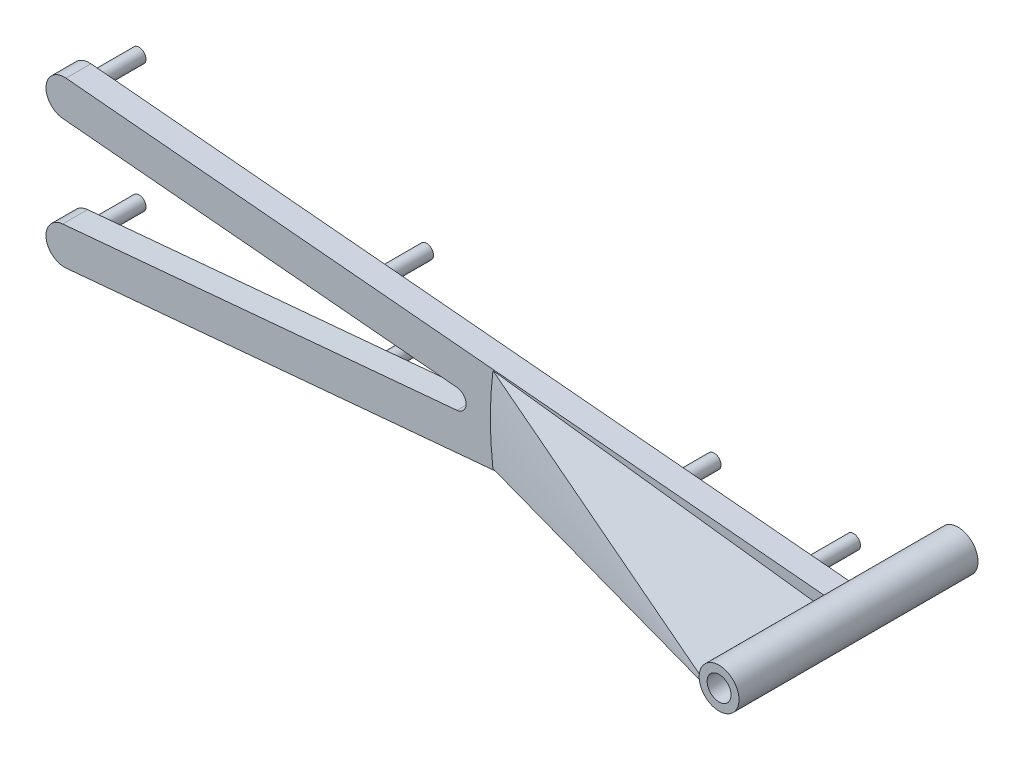
ISO-10303-21;
HEADER;
FILE_DESCRIPTION(('STEP AP214'),'2;1');
FILE_NAME('part.step','',(''),(''),'','','');
FILE_SCHEMA(('AUTOMOTIVE_DESIGN { 1 0 10303 214 1 1 1 1 }'));
ENDSEC;
DATA;
#1=APPLICATION_CONTEXT('core data for automotive mechanical design processes');
#2=APPLICATION_PROTOCOL_DEFINITION('international standard','automotive_design',2000,#1);
#3=PRODUCT_CONTEXT('',#1,'mechanical');
#4=PRODUCT('Part','Part','',(#3));
#5=PRODUCT_RELATED_PRODUCT_CATEGORY('part','',(#4));
#6=PRODUCT_DEFINITION_FORMATION('','',#4);
#7=PRODUCT_DEFINITION_CONTEXT('part definition',#1,'design');
#8=PRODUCT_DEFINITION('design','',#6,#7);
#9=PRODUCT_DEFINITION_SHAPE('','',#8);
#10=(LENGTH_UNIT() NAMED_UNIT(*) SI_UNIT(.MILLI.,.METRE.));
#11=(NAMED_UNIT(*) PLANE_ANGLE_UNIT() SI_UNIT($,.RADIAN.));
#12=(NAMED_UNIT(*) SI_UNIT($,.STERADIAN.) SOLID_ANGLE_UNIT());
#13=UNCERTAINTY_MEASURE_WITH_UNIT(LENGTH_MEASURE(1.E-05),#10,'distance_accuracy_value','');
#14=(GEOMETRIC_REPRESENTATION_CONTEXT(3) GLOBAL_UNCERTAINTY_ASSIGNED_CONTEXT((#13)) GLOBAL_UNIT_ASSIGNED_CONTEXT((#10,
#11,#12)) REPRESENTATION_CONTEXT('',''));
#15=CARTESIAN_POINT('',(0.,0.,0.));
#16=DIRECTION('',(0.,0.,1.));
#17=DIRECTION('',(1.,0.,0.));
#18=AXIS2_PLACEMENT_3D('',#15,#16,#17);
#19=CARTESIAN_POINT('',(544.102231746038,-8.15707225850537,8.255));
#20=DIRECTION('',(0.,0.,1.));
#21=DIRECTION('',(1.,0.,0.));
#22=AXIS2_PLACEMENT_3D('',#19,#20,#21);
#23=PLANE('',#22);
#24=CARTESIAN_POINT('',(642.837082689009,0.,8.255));
#25=DIRECTION('',(0.,0.,1.));
#26=DIRECTION('',(1.,0.,0.));
#27=AXIS2_PLACEMENT_3D('',#24,#25,#26);
#28=CIRCLE('',#27,2.53999999999984);
#29=CARTESIAN_POINT('',(640.969745333569,-1.72181625064283,8.255));
#30=VERTEX_POINT('',#29);
#31=CARTESIAN_POINT('',(640.31601546384,-0.309548132249066,8.255));
#32=VERTEX_POINT('',#31);
#33=EDGE_CURVE('E192',#30,#32,#28,.F.);
#34=ORIENTED_EDGE('',*,*,#33,.T.);
#35=DIRECTION('',(-0.992546151641322,-0.121869343405148,0.));
#36=VECTOR('',#35,1.);
#37=CARTESIAN_POINT('',(4.79161013369886,-78.3421331837901,8.25500000000008));
#38=LINE('',#37,#36);
#39=CARTESIAN_POINT('',(598.756563819367,-5.41240715378111,8.25500000000001));
#40=VERTEX_POINT('',#39);
#41=EDGE_CURVE('E272',#32,#40,#38,.T.);
#42=ORIENTED_EDGE('',*,*,#41,.T.);
#43=CARTESIAN_POINT('',(642.837082689009,0.,8.25500000000001));
#44=DIRECTION('',(0.,0.,-1.));
#45=DIRECTION('',(-1.,0.,0.));
#46=AXIS2_PLACEMENT_3D('',#43,#44,#45);
#47=CIRCLE('',#46,44.4115558724877);
#48=CARTESIAN_POINT('',(598.756563819367,5.41240715378112,8.25500000000001));
#49=VERTEX_POINT('',#48);
#50=EDGE_CURVE('E267',#40,#49,#47,.T.);
#51=ORIENTED_EDGE('',*,*,#50,.T.);
#52=DIRECTION('',(-0.992546151641322,0.121869343405148,0.));
#53=VECTOR('',#52,1.);
#54=CARTESIAN_POINT('',(4.79161013369889,78.3421331837901,8.25500000000008));
#55=LINE('',#54,#53);
#56=CARTESIAN_POINT('',(640.31601546384,0.309548132249052,8.255));
#57=VERTEX_POINT('',#56);
#58=EDGE_CURVE('E142',#57,#49,#55,.T.);
#59=ORIENTED_EDGE('',*,*,#58,.F.);
#60=CARTESIAN_POINT('',(640.969745333569,1.72181625064275,8.255));
#61=VERTEX_POINT('',#60);
#62=EDGE_CURVE('E149',#57,#61,#28,.F.);
#63=ORIENTED_EDGE('',*,*,#62,.T.);
#64=DIRECTION('',(-0.995912017990539,0.090328580316597,0.));
#65=VECTOR('',#64,1.);
#66=CARTESIAN_POINT('',(640.969745333569,1.72181625064282,8.255));
#67=LINE('',#66,#65);
#68=CARTESIAN_POINT('',(544.31368699473,10.4884586558245,8.255));
#69=VERTEX_POINT('',#68);
#70=EDGE_CURVE('E165',#61,#69,#67,.T.);
#71=ORIENTED_EDGE('',*,*,#70,.T.);
#72=CARTESIAN_POINT('',(544.102231746038,8.15707225850582,8.255));
#73=DIRECTION('',(0.,0.,1.));
#74=DIRECTION('',(1.,0.,0.));
#75=AXIS2_PLACEMENT_3D('',#72,#73,#74);
#76=CIRCLE('',#75,2.34095618408417);
#77=CARTESIAN_POINT('',(543.890776497347,5.82568586118712,8.255));
#78=VERTEX_POINT('',#77);
#79=EDGE_CURVE('E168',#69,#78,#76,.T.);
#80=ORIENTED_EDGE('',*,*,#79,.T.);
#81=DIRECTION('',(0.995912017990539,-0.0903285803166027,0.));
#82=VECTOR('',#81,1.);
#83=CARTESIAN_POINT('',(608.121505485427,0.,8.255));
#84=LINE('',#83,#82);
#85=CARTESIAN_POINT('',(594.176442416695,1.26480826284806,8.255));
#86=VERTEX_POINT('',#85);
#87=EDGE_CURVE('E170',#78,#86,#84,.T.);
#88=ORIENTED_EDGE('',*,*,#87,.T.);
#89=CARTESIAN_POINT('',(594.061725119693,0.,8.255));
#90=DIRECTION('',(0.,0.,1.));
#91=DIRECTION('',(1.,0.,0.));
#92=AXIS2_PLACEMENT_3D('',#89,#90,#91);
#93=CIRCLE('',#92,1.27);
#94=CARTESIAN_POINT('',(594.176442416695,-1.26480826284791,8.255));
#95=VERTEX_POINT('',#94);
#96=EDGE_CURVE('E11',#86,#95,#93,.F.);
#97=ORIENTED_EDGE('',*,*,#96,.T.);
#98=DIRECTION('',(-0.995912017990539,-0.0903285803165969,0.));
#99=VECTOR('',#98,1.);
#100=CARTESIAN_POINT('',(608.121505485427,0.,8.255));
#101=LINE('',#100,#99);
#102=CARTESIAN_POINT('',(543.890776497347,-5.82568586118667,8.255));
#103=VERTEX_POINT('',#102);
#104=EDGE_CURVE('E172',#95,#103,#101,.T.);
#105=ORIENTED_EDGE('',*,*,#104,.T.);
#106=CARTESIAN_POINT('',(544.102231746038,-8.15707225850537,8.255));
#107=DIRECTION('',(0.,0.,1.));
#108=DIRECTION('',(1.,0.,0.));
#109=AXIS2_PLACEMENT_3D('',#106,#107,#108);
#110=CIRCLE('',#109,2.34095618408416);
#111=CARTESIAN_POINT('',(544.31368699473,-10.4884586558241,8.255));
#112=VERTEX_POINT('',#111);
#113=EDGE_CURVE('E174',#103,#112,#110,.T.);
#114=ORIENTED_EDGE('',*,*,#113,.T.);
#115=DIRECTION('',(0.995912017990539,0.0903285803165972,0.));
#116=VECTOR('',#115,1.);
#117=CARTESIAN_POINT('',(617.6485379377,-3.83703478127984,8.255));
#118=LINE('',#117,#116);
#119=EDGE_CURVE('E163',#112,#30,#118,.T.);
#120=ORIENTED_EDGE('',*,*,#119,.T.);
#121=EDGE_LOOP('',(#34,#42,#51,#59,#63,#71,#80,#88,#97,#105,#114,#120));
#122=FACE_BOUND('',#121,.T.);
#123=ADVANCED_FACE('F41',(#122),#23,.T.);
#124=CARTESIAN_POINT('',(642.837082689009,0.,8.255));
#125=DIRECTION('',(0.,0.,-1.));
#126=DIRECTION('',(-1.,0.,0.));
#127=AXIS2_PLACEMENT_3D('',#124,#125,#126);
#128=CYLINDRICAL_SURFACE('',#127,2.5399999999999);
#129=CARTESIAN_POINT('',(642.837082689009,0.,-6.985));
#130=DIRECTION('',(0.,0.,1.));
#131=DIRECTION('',(1.,0.,0.));
#132=AXIS2_PLACEMENT_3D('',#129,#130,#131);
#133=CIRCLE('',#132,2.53999999999984);
#134=CARTESIAN_POINT('',(645.377082689008,0.,-6.985));
#135=VERTEX_POINT('',#134);
#136=EDGE_CURVE('E152',#135,#135,#133,.T.);
#137=ORIENTED_EDGE('',*,*,#136,.T.);
#138=EDGE_LOOP('',(#137));
#139=FACE_BOUND('',#138,.T.);
#140=DIRECTION('',(0.,0.,1.));
#141=VECTOR('',#140,1.);
#142=CARTESIAN_POINT('',(640.31601546384,-0.309548132249066,0.));
#143=LINE('',#142,#141);
#144=CARTESIAN_POINT('',(640.31601546384,-0.309548132249054,23.495));
#145=VERTEX_POINT('',#144);
#146=EDGE_CURVE('E56',#32,#145,#143,.T.);
#147=ORIENTED_EDGE('',*,*,#146,.F.);
#148=ORIENTED_EDGE('',*,*,#33,.F.);
#149=DIRECTION('',(0.,0.,-1.));
#150=VECTOR('',#149,1.);
#151=CARTESIAN_POINT('',(640.969745333569,-1.72181625064283,8.255));
#152=LINE('',#151,#150);
#153=CARTESIAN_POINT('',(640.969745333569,-1.72181625064282,5.08));
#154=VERTEX_POINT('',#153);
#155=EDGE_CURVE('E246',#30,#154,#152,.T.);
#156=ORIENTED_EDGE('',*,*,#155,.T.);
#157=CARTESIAN_POINT('',(642.837082689009,0.,5.08));
#158=DIRECTION('',(0.,0.,1.));
#159=DIRECTION('',(1.,0.,0.));
#160=AXIS2_PLACEMENT_3D('',#157,#158,#159);
#161=CIRCLE('',#160,2.53999999999984);
#162=CARTESIAN_POINT('',(640.969745333569,1.72181625064282,5.08));
#163=VERTEX_POINT('',#162);
#164=EDGE_CURVE('E134',#154,#163,#161,.F.);
#165=ORIENTED_EDGE('',*,*,#164,.T.);
#166=DIRECTION('',(0.,0.,-1.));
#167=VECTOR('',#166,1.);
#168=CARTESIAN_POINT('',(640.969745333569,1.72181625064282,8.255));
#169=LINE('',#168,#167);
#170=EDGE_CURVE('E248',#61,#163,#169,.T.);
#171=ORIENTED_EDGE('',*,*,#170,.F.);
#172=ORIENTED_EDGE('',*,*,#62,.F.);
#173=DIRECTION('',(0.,0.,1.));
#174=VECTOR('',#173,1.);
#175=CARTESIAN_POINT('',(640.31601546384,0.309548132249052,0.));
#176=LINE('',#175,#174);
#177=CARTESIAN_POINT('',(640.31601546384,0.309548132249052,23.495));
#178=VERTEX_POINT('',#177);
#179=EDGE_CURVE('E140',#57,#178,#176,.T.);
#180=ORIENTED_EDGE('',*,*,#179,.T.);
#181=CARTESIAN_POINT('',(642.837082689009,0.,23.495));
#182=DIRECTION('',(0.,0.,1.));
#183=DIRECTION('',(1.,0.,0.));
#184=AXIS2_PLACEMENT_3D('',#181,#182,#183);
#185=CIRCLE('',#184,2.53999999999984);
#186=EDGE_CURVE('E135',#145,#178,#185,.T.);
#187=ORIENTED_EDGE('',*,*,#186,.F.);
#188=EDGE_LOOP('',(#147,#148,#156,#165,#171,#172,#180,#187));
#189=FACE_BOUND('',#188,.T.);
#190=ADVANCED_FACE('F147',(#139,#189),#128,.T.);
#191=CARTESIAN_POINT('',(544.102231746038,-8.15707225850537,5.08));
#192=DIRECTION('',(0.,0.,1.));
#193=DIRECTION('',(1.,0.,0.));
#194=AXIS2_PLACEMENT_3D('',#191,#192,#193);
#195=PLANE('',#194);
#196=CARTESIAN_POINT('',(635.217082689009,0.,5.08));
#197=DIRECTION('',(0.,0.,1.));
#198=DIRECTION('',(1.,0.,0.));
#199=AXIS2_PLACEMENT_3D('',#196,#197,#198);
#200=CIRCLE('',#199,0.889000000000045);
#201=CARTESIAN_POINT('',(636.106082689009,0.,5.08));
#202=VERTEX_POINT('',#201);
#203=EDGE_CURVE('E204',#202,#202,#200,.F.);
#204=ORIENTED_EDGE('',*,*,#203,.F.);
#205=EDGE_LOOP('',(#204));
#206=FACE_BOUND('',#205,.T.);
#207=CARTESIAN_POINT('',(617.437082689009,0.,5.08));
#208=DIRECTION('',(0.,0.,1.));
#209=DIRECTION('',(1.,0.,0.));
#210=AXIS2_PLACEMENT_3D('',#207,#208,#209);
#211=CIRCLE('',#210,0.889000000000045);
#212=CARTESIAN_POINT('',(618.326082689009,0.,5.08));
#213=VERTEX_POINT('',#212);
#214=EDGE_CURVE('E201',#213,#213,#211,.F.);
#215=ORIENTED_EDGE('',*,*,#214,.F.);
#216=EDGE_LOOP('',(#215));
#217=FACE_BOUND('',#216,.T.);
#218=CARTESIAN_POINT('',(580.769657217523,-4.83136032123327,5.08));
#219=DIRECTION('',(0.,0.,1.));
#220=DIRECTION('',(1.,0.,0.));
#221=AXIS2_PLACEMENT_3D('',#218,#219,#220);
#222=CIRCLE('',#221,0.889000000000045);
#223=CARTESIAN_POINT('',(581.658657217523,-4.83136032123327,5.08));
#224=VERTEX_POINT('',#223);
#225=EDGE_CURVE('E198',#224,#224,#222,.F.);
#226=ORIENTED_EDGE('',*,*,#225,.F.);
#227=EDGE_LOOP('',(#226));
#228=FACE_BOUND('',#227,.T.);
#229=CARTESIAN_POINT('',(580.769657217523,4.8313603212335,5.08));
#230=DIRECTION('',(0.,0.,1.));
#231=DIRECTION('',(1.,0.,0.));
#232=AXIS2_PLACEMENT_3D('',#229,#230,#231);
#233=CIRCLE('',#232,0.889000000000045);
#234=CARTESIAN_POINT('',(581.658657217523,4.8313603212335,5.08));
#235=VERTEX_POINT('',#234);
#236=EDGE_CURVE('E195',#235,#235,#233,.F.);
#237=ORIENTED_EDGE('',*,*,#236,.F.);
#238=EDGE_LOOP('',(#237));
#239=FACE_BOUND('',#238,.T.);
#240=CARTESIAN_POINT('',(544.102231746038,-8.15707225850537,5.08));
#241=DIRECTION('',(0.,0.,1.));
#242=DIRECTION('',(1.,0.,0.));
#243=AXIS2_PLACEMENT_3D('',#240,#241,#242);
#244=CIRCLE('',#243,0.889000000000045);
#245=CARTESIAN_POINT('',(544.991231746038,-8.15707225850537,5.08));
#246=VERTEX_POINT('',#245);
#247=EDGE_CURVE('E191',#246,#246,#244,.F.);
#248=ORIENTED_EDGE('',*,*,#247,.F.);
#249=EDGE_LOOP('',(#248));
#250=FACE_BOUND('',#249,.T.);
#251=CARTESIAN_POINT('',(544.102231746038,8.15707225850582,5.08));
#252=DIRECTION('',(0.,0.,1.));
#253=DIRECTION('',(1.,0.,0.));
#254=AXIS2_PLACEMENT_3D('',#251,#252,#253);
#255=CIRCLE('',#254,0.889000000000045);
#256=CARTESIAN_POINT('',(544.991231746038,8.15707225850582,5.08));
#257=VERTEX_POINT('',#256);
#258=EDGE_CURVE('E188',#257,#257,#255,.F.);
#259=ORIENTED_EDGE('',*,*,#258,.F.);
#260=EDGE_LOOP('',(#259));
#261=FACE_BOUND('',#260,.T.);
#262=ORIENTED_EDGE('',*,*,#164,.F.);
#263=DIRECTION('',(0.995912017990539,0.0903285803165964,0.));
#264=VECTOR('',#263,1.);
#265=CARTESIAN_POINT('',(640.969745333569,-1.72181625064283,5.08));
#266=LINE('',#265,#264);
#267=CARTESIAN_POINT('',(544.31368699473,-10.4884586558241,5.08));
#268=VERTEX_POINT('',#267);
#269=EDGE_CURVE('E162',#268,#154,#266,.T.);
#270=ORIENTED_EDGE('',*,*,#269,.F.);
#271=CARTESIAN_POINT('',(544.102231746038,-8.15707225850537,5.08));
#272=DIRECTION('',(0.,0.,1.));
#273=DIRECTION('',(1.,0.,0.));
#274=AXIS2_PLACEMENT_3D('',#271,#272,#273);
#275=CIRCLE('',#274,2.34095618408416);
#276=CARTESIAN_POINT('',(543.890776497347,-5.82568586118667,5.08));
#277=VERTEX_POINT('',#276);
#278=EDGE_CURVE('E166',#277,#268,#275,.T.);
#279=ORIENTED_EDGE('',*,*,#278,.F.);
#280=DIRECTION('',(-0.995912017990539,-0.0903285803165969,0.));
#281=VECTOR('',#280,1.);
#282=CARTESIAN_POINT('',(608.121505485427,0.,5.08));
#283=LINE('',#282,#281);
#284=CARTESIAN_POINT('',(594.176442416695,-1.26480826284791,5.08));
#285=VERTEX_POINT('',#284);
#286=EDGE_CURVE('E216',#285,#277,#283,.T.);
#287=ORIENTED_EDGE('',*,*,#286,.F.);
#288=CARTESIAN_POINT('',(594.061725119693,0.,5.08));
#289=DIRECTION('',(0.,0.,1.));
#290=DIRECTION('',(1.,0.,0.));
#291=AXIS2_PLACEMENT_3D('',#288,#289,#290);
#292=CIRCLE('',#291,1.27);
#293=CARTESIAN_POINT('',(594.176442416695,1.26480826284806,5.08));
#294=VERTEX_POINT('',#293);
#295=EDGE_CURVE('E49',#285,#294,#292,.T.);
#296=ORIENTED_EDGE('',*,*,#295,.T.);
#297=DIRECTION('',(0.995912017990539,-0.0903285803166027,0.));
#298=VECTOR('',#297,1.);
#299=CARTESIAN_POINT('',(608.121505485427,0.,5.08));
#300=LINE('',#299,#298);
#301=CARTESIAN_POINT('',(543.890776497347,5.82568586118712,5.08));
#302=VERTEX_POINT('',#301);
#303=EDGE_CURVE('E213',#302,#294,#300,.T.);
#304=ORIENTED_EDGE('',*,*,#303,.F.);
#305=CARTESIAN_POINT('',(544.102231746038,8.15707225850582,5.08));
#306=DIRECTION('',(0.,0.,1.));
#307=DIRECTION('',(1.,0.,0.));
#308=AXIS2_PLACEMENT_3D('',#305,#306,#307);
#309=CIRCLE('',#308,2.34095618408417);
#310=CARTESIAN_POINT('',(544.31368699473,10.4884586558245,5.08));
#311=VERTEX_POINT('',#310);
#312=EDGE_CURVE('E185',#311,#302,#309,.T.);
#313=ORIENTED_EDGE('',*,*,#312,.F.);
#314=DIRECTION('',(-0.995912017990539,0.090328580316603,0.));
#315=VECTOR('',#314,1.);
#316=CARTESIAN_POINT('',(617.6485379377,3.83703478127986,5.08));
#317=LINE('',#316,#315);
#318=EDGE_CURVE('E186',#163,#311,#317,.T.);
#319=ORIENTED_EDGE('',*,*,#318,.F.);
#320=EDGE_LOOP('',(#262,#270,#279,#287,#296,#304,#313,#319));
#321=FACE_BOUND('',#320,.T.);
#322=ADVANCED_FACE('F212',(#206,#217,#228,#239,#250,#261,#321),#195,.F.);
#323=CARTESIAN_POINT('',(640.969745333569,-1.72181625064283,8.255));
#324=DIRECTION('',(-0.0903285803165964,0.995912017990539,0.));
#325=DIRECTION('',(-0.995912017990539,-0.0903285803165964,0.));
#326=AXIS2_PLACEMENT_3D('',#323,#324,#325);
#327=PLANE('',#326);
#328=ORIENTED_EDGE('',*,*,#269,.T.);
#329=ORIENTED_EDGE('',*,*,#155,.F.);
#330=ORIENTED_EDGE('',*,*,#119,.F.);
#331=DIRECTION('',(0.,0.,-1.));
#332=VECTOR('',#331,1.);
#333=CARTESIAN_POINT('',(544.31368699473,-10.4884586558241,8.255));
#334=LINE('',#333,#332);
#335=EDGE_CURVE('E176',#112,#268,#334,.T.);
#336=ORIENTED_EDGE('',*,*,#335,.T.);
#337=EDGE_LOOP('',(#328,#329,#330,#336));
#338=FACE_BOUND('',#337,.T.);
#339=ADVANCED_FACE('F247',(#338),#327,.F.);
#340=CARTESIAN_POINT('',(617.6485379377,3.83703478127986,8.255));
#341=DIRECTION('',(-0.090328580316603,-0.995912017990539,0.));
#342=DIRECTION('',(0.995912017990539,-0.090328580316603,0.));
#343=AXIS2_PLACEMENT_3D('',#340,#341,#342);
#344=PLANE('',#343);
#345=ORIENTED_EDGE('',*,*,#170,.T.);
#346=ORIENTED_EDGE('',*,*,#318,.T.);
#347=DIRECTION('',(0.,0.,-1.));
#348=VECTOR('',#347,1.);
#349=CARTESIAN_POINT('',(544.31368699473,10.4884586558245,8.255));
#350=LINE('',#349,#348);
#351=EDGE_CURVE('E253',#69,#311,#350,.T.);
#352=ORIENTED_EDGE('',*,*,#351,.F.);
#353=ORIENTED_EDGE('',*,*,#70,.F.);
#354=EDGE_LOOP('',(#345,#346,#352,#353));
#355=FACE_BOUND('',#354,.T.);
#356=ADVANCED_FACE('F265',(#355),#344,.F.);
#357=CARTESIAN_POINT('',(544.102231746038,8.15707225850582,8.255));
#358=DIRECTION('',(0.,0.,-1.));
#359=DIRECTION('',(-1.,0.,0.));
#360=AXIS2_PLACEMENT_3D('',#357,#358,#359);
#361=CYLINDRICAL_SURFACE('',#360,2.34095618408417);
#362=ORIENTED_EDGE('',*,*,#312,.T.);
#363=DIRECTION('',(0.,0.,-1.));
#364=VECTOR('',#363,1.);
#365=CARTESIAN_POINT('',(543.890776497347,5.82568586118712,8.255));
#366=LINE('',#365,#364);
#367=EDGE_CURVE('E222',#78,#302,#366,.T.);
#368=ORIENTED_EDGE('',*,*,#367,.F.);
#369=ORIENTED_EDGE('',*,*,#79,.F.);
#370=ORIENTED_EDGE('',*,*,#351,.T.);
#371=EDGE_LOOP('',(#362,#368,#369,#370));
#372=FACE_BOUND('',#371,.T.);
#373=ADVANCED_FACE('F260',(#372),#361,.T.);
#374=CARTESIAN_POINT('',(608.121505485427,0.,8.255));
#375=DIRECTION('',(0.0903285803166027,0.995912017990539,0.));
#376=DIRECTION('',(-0.995912017990539,0.0903285803166027,0.));
#377=AXIS2_PLACEMENT_3D('',#374,#375,#376);
#378=PLANE('',#377);
#379=ORIENTED_EDGE('',*,*,#303,.T.);
#380=DIRECTION('',(0.,0.,-1.));
#381=VECTOR('',#380,1.);
#382=CARTESIAN_POINT('',(594.176442416695,1.26480826284806,8.255));
#383=LINE('',#382,#381);
#384=EDGE_CURVE('E64',#294,#86,#383,.F.);
#385=ORIENTED_EDGE('',*,*,#384,.T.);
#386=ORIENTED_EDGE('',*,*,#87,.F.);
#387=ORIENTED_EDGE('',*,*,#367,.T.);
#388=EDGE_LOOP('',(#379,#385,#386,#387));
#389=FACE_BOUND('',#388,.T.);
#390=ADVANCED_FACE('F220',(#389),#378,.F.);
#391=CARTESIAN_POINT('',(608.121505485427,0.,8.255));
#392=DIRECTION('',(0.0903285803165969,-0.995912017990539,0.));
#393=DIRECTION('',(0.995912017990539,0.090328580316597,0.));
#394=AXIS2_PLACEMENT_3D('',#391,#392,#393);
#395=PLANE('',#394);
#396=ORIENTED_EDGE('',*,*,#104,.F.);
#397=DIRECTION('',(0.,0.,-1.));
#398=VECTOR('',#397,1.);
#399=CARTESIAN_POINT('',(594.176442416695,-1.26480826284791,5.08));
#400=LINE('',#399,#398);
#401=EDGE_CURVE('E207',#95,#285,#400,.T.);
#402=ORIENTED_EDGE('',*,*,#401,.T.);
#403=ORIENTED_EDGE('',*,*,#286,.T.);
#404=DIRECTION('',(0.,0.,-1.));
#405=VECTOR('',#404,1.);
#406=CARTESIAN_POINT('',(543.890776497347,-5.82568586118667,8.255));
#407=LINE('',#406,#405);
#408=EDGE_CURVE('E232',#103,#277,#407,.T.);
#409=ORIENTED_EDGE('',*,*,#408,.F.);
#410=EDGE_LOOP('',(#396,#402,#403,#409));
#411=FACE_BOUND('',#410,.T.);
#412=ADVANCED_FACE('F230',(#411),#395,.F.);
#413=CARTESIAN_POINT('',(544.102231746038,-8.15707225850537,8.255));
#414=DIRECTION('',(0.,0.,-1.));
#415=DIRECTION('',(-1.,0.,0.));
#416=AXIS2_PLACEMENT_3D('',#413,#414,#415);
#417=CYLINDRICAL_SURFACE('',#416,2.34095618408416);
#418=ORIENTED_EDGE('',*,*,#278,.T.);
#419=ORIENTED_EDGE('',*,*,#335,.F.);
#420=ORIENTED_EDGE('',*,*,#113,.F.);
#421=ORIENTED_EDGE('',*,*,#408,.T.);
#422=EDGE_LOOP('',(#418,#419,#420,#421));
#423=FACE_BOUND('',#422,.T.);
#424=ADVANCED_FACE('F238',(#423),#417,.T.);
#425=CARTESIAN_POINT('',(642.837082689009,0.,23.495));
#426=DIRECTION('',(0.,0.,1.));
#427=DIRECTION('',(1.,0.,0.));
#428=AXIS2_PLACEMENT_3D('',#425,#426,#427);
#429=PLANE('',#428);
#430=CARTESIAN_POINT('',(642.837082689009,0.,23.495));
#431=DIRECTION('',(0.,0.,1.));
#432=DIRECTION('',(1.,0.,0.));
#433=AXIS2_PLACEMENT_3D('',#430,#431,#432);
#434=CIRCLE('',#433,1.52400000000007);
#435=CARTESIAN_POINT('',(644.361082689009,0.,23.495));
#436=VERTEX_POINT('',#435);
#437=EDGE_CURVE('E157',#436,#436,#434,.T.);
#438=ORIENTED_EDGE('',*,*,#437,.F.);
#439=EDGE_LOOP('',(#438));
#440=FACE_BOUND('',#439,.T.);
#441=EDGE_CURVE('E125',#178,#145,#185,.T.);
#442=ORIENTED_EDGE('',*,*,#441,.T.);
#443=ORIENTED_EDGE('',*,*,#186,.T.);
#444=EDGE_LOOP('',(#442,#443));
#445=FACE_BOUND('',#444,.T.);
#446=ADVANCED_FACE('F151',(#440,#445),#429,.T.);
#447=CARTESIAN_POINT('',(642.837082689009,0.,-6.985));
#448=DIRECTION('',(0.,0.,1.));
#449=DIRECTION('',(1.,0.,0.));
#450=AXIS2_PLACEMENT_3D('',#447,#448,#449);
#451=PLANE('',#450);
#452=ORIENTED_EDGE('',*,*,#136,.F.);
#453=EDGE_LOOP('',(#452));
#454=FACE_BOUND('',#453,.T.);
#455=ADVANCED_FACE('F301',(#454),#451,.F.);
#456=CARTESIAN_POINT('',(642.837082689009,0.,-1.905));
#457=DIRECTION('',(0.,0.,1.));
#458=DIRECTION('',(1.,0.,0.));
#459=AXIS2_PLACEMENT_3D('',#456,#457,#458);
#460=CYLINDRICAL_SURFACE('',#459,1.52400000000007);
#461=CARTESIAN_POINT('',(642.837082689009,0.,-1.905));
#462=DIRECTION('',(0.,0.,1.));
#463=DIRECTION('',(1.,0.,0.));
#464=AXIS2_PLACEMENT_3D('',#461,#462,#463);
#465=CIRCLE('',#464,1.52400000000007);
#466=CARTESIAN_POINT('',(644.361082689009,0.,-1.905));
#467=VERTEX_POINT('',#466);
#468=EDGE_CURVE('E154',#467,#467,#465,.T.);
#469=ORIENTED_EDGE('',*,*,#468,.F.);
#470=EDGE_LOOP('',(#469));
#471=FACE_BOUND('',#470,.T.);
#472=ORIENTED_EDGE('',*,*,#437,.T.);
#473=EDGE_LOOP('',(#472));
#474=FACE_BOUND('',#473,.T.);
#475=ADVANCED_FACE('F298',(#471,#474),#460,.F.);
#476=CARTESIAN_POINT('',(642.837082689009,0.,-1.905));
#477=DIRECTION('',(0.,0.,1.));
#478=DIRECTION('',(1.,0.,0.));
#479=AXIS2_PLACEMENT_3D('',#476,#477,#478);
#480=PLANE('',#479);
#481=ORIENTED_EDGE('',*,*,#468,.T.);
#482=EDGE_LOOP('',(#481));
#483=FACE_BOUND('',#482,.T.);
#484=ADVANCED_FACE('F368',(#483),#480,.T.);
#485=CARTESIAN_POINT('',(544.102231746038,8.15707225850582,-1.27));
#486=DIRECTION('',(0.,0.,1.));
#487=DIRECTION('',(1.,0.,0.));
#488=AXIS2_PLACEMENT_3D('',#485,#486,#487);
#489=CYLINDRICAL_SURFACE('',#488,0.889000000000045);
#490=CARTESIAN_POINT('',(544.102231746038,8.15707225850582,-1.27));
#491=DIRECTION('',(0.,0.,-1.));
#492=DIRECTION('',(-1.,0.,0.));
#493=AXIS2_PLACEMENT_3D('',#490,#491,#492);
#494=CIRCLE('',#493,0.889000000000045);
#495=CARTESIAN_POINT('',(543.213231746038,8.15707225850582,-1.27));
#496=VERTEX_POINT('',#495);
#497=EDGE_CURVE('E290',#496,#496,#494,.T.);
#498=ORIENTED_EDGE('',*,*,#497,.F.);
#499=EDGE_LOOP('',(#498));
#500=FACE_BOUND('',#499,.T.);
#501=ORIENTED_EDGE('',*,*,#258,.T.);
#502=EDGE_LOOP('',(#501));
#503=FACE_BOUND('',#502,.T.);
#504=ADVANCED_FACE('F362',(#500,#503),#489,.T.);
#505=CARTESIAN_POINT('',(544.102231746038,8.15707225850582,-1.27));
#506=DIRECTION('',(0.,0.,-1.));
#507=DIRECTION('',(-1.,0.,0.));
#508=AXIS2_PLACEMENT_3D('',#505,#506,#507);
#509=PLANE('',#508);
#510=ORIENTED_EDGE('',*,*,#497,.T.);
#511=EDGE_LOOP('',(#510));
#512=FACE_BOUND('',#511,.T.);
#513=ADVANCED_FACE('F367',(#512),#509,.T.);
#514=CARTESIAN_POINT('',(544.102231746038,-8.15707225850537,-1.27));
#515=DIRECTION('',(0.,0.,1.));
#516=DIRECTION('',(1.,0.,0.));
#517=AXIS2_PLACEMENT_3D('',#514,#515,#516);
#518=CYLINDRICAL_SURFACE('',#517,0.889000000000045);
#519=CARTESIAN_POINT('',(544.102231746038,-8.15707225850537,-1.27));
#520=DIRECTION('',(0.,0.,-1.));
#521=DIRECTION('',(-1.,0.,0.));
#522=AXIS2_PLACEMENT_3D('',#519,#520,#521);
#523=CIRCLE('',#522,0.889000000000045);
#524=CARTESIAN_POINT('',(543.213231746038,-8.15707225850537,-1.27));
#525=VERTEX_POINT('',#524);
#526=EDGE_CURVE('E287',#525,#525,#523,.T.);
#527=ORIENTED_EDGE('',*,*,#526,.F.);
#528=EDGE_LOOP('',(#527));
#529=FACE_BOUND('',#528,.T.);
#530=ORIENTED_EDGE('',*,*,#247,.T.);
#531=EDGE_LOOP('',(#530));
#532=FACE_BOUND('',#531,.T.);
#533=ADVANCED_FACE('F380',(#529,#532),#518,.T.);
#534=CARTESIAN_POINT('',(544.102231746038,-8.15707225850537,-1.27));
#535=DIRECTION('',(0.,0.,-1.));
#536=DIRECTION('',(-1.,0.,0.));
#537=AXIS2_PLACEMENT_3D('',#534,#535,#536);
#538=PLANE('',#537);
#539=ORIENTED_EDGE('',*,*,#526,.T.);
#540=EDGE_LOOP('',(#539));
#541=FACE_BOUND('',#540,.T.);
#542=ADVANCED_FACE('F390',(#541),#538,.T.);
#543=CARTESIAN_POINT('',(580.769657217523,4.8313603212335,-1.27));
#544=DIRECTION('',(0.,0.,1.));
#545=DIRECTION('',(1.,0.,0.));
#546=AXIS2_PLACEMENT_3D('',#543,#544,#545);
#547=CYLINDRICAL_SURFACE('',#546,0.889000000000045);
#548=CARTESIAN_POINT('',(580.769657217523,4.8313603212335,-1.27));
#549=DIRECTION('',(0.,0.,-1.));
#550=DIRECTION('',(-1.,0.,0.));
#551=AXIS2_PLACEMENT_3D('',#548,#549,#550);
#552=CIRCLE('',#551,0.889000000000045);
#553=CARTESIAN_POINT('',(579.880657217523,4.8313603212335,-1.27));
#554=VERTEX_POINT('',#553);
#555=EDGE_CURVE('E284',#554,#554,#552,.T.);
#556=ORIENTED_EDGE('',*,*,#555,.F.);
#557=EDGE_LOOP('',(#556));
#558=FACE_BOUND('',#557,.T.);
#559=ORIENTED_EDGE('',*,*,#236,.T.);
#560=EDGE_LOOP('',(#559));
#561=FACE_BOUND('',#560,.T.);
#562=ADVANCED_FACE('F400',(#558,#561),#547,.T.);
#563=CARTESIAN_POINT('',(580.769657217523,4.8313603212335,-1.27));
#564=DIRECTION('',(0.,0.,-1.));
#565=DIRECTION('',(-1.,0.,0.));
#566=AXIS2_PLACEMENT_3D('',#563,#564,#565);
#567=PLANE('',#566);
#568=ORIENTED_EDGE('',*,*,#555,.T.);
#569=EDGE_LOOP('',(#568));
#570=FACE_BOUND('',#569,.T.);
#571=ADVANCED_FACE('F410',(#570),#567,.T.);
#572=CARTESIAN_POINT('',(580.769657217523,-4.83136032123327,-1.27));
#573=DIRECTION('',(0.,0.,1.));
#574=DIRECTION('',(1.,0.,0.));
#575=AXIS2_PLACEMENT_3D('',#572,#573,#574);
#576=CYLINDRICAL_SURFACE('',#575,0.889000000000045);
#577=CARTESIAN_POINT('',(580.769657217523,-4.83136032123327,-1.27));
#578=DIRECTION('',(0.,0.,-1.));
#579=DIRECTION('',(-1.,0.,0.));
#580=AXIS2_PLACEMENT_3D('',#577,#578,#579);
#581=CIRCLE('',#580,0.889000000000045);
#582=CARTESIAN_POINT('',(579.880657217523,-4.83136032123327,-1.27));
#583=VERTEX_POINT('',#582);
#584=EDGE_CURVE('E281',#583,#583,#581,.T.);
#585=ORIENTED_EDGE('',*,*,#584,.F.);
#586=EDGE_LOOP('',(#585));
#587=FACE_BOUND('',#586,.T.);
#588=ORIENTED_EDGE('',*,*,#225,.T.);
#589=EDGE_LOOP('',(#588));
#590=FACE_BOUND('',#589,.T.);
#591=ADVANCED_FACE('F420',(#587,#590),#576,.T.);
#592=CARTESIAN_POINT('',(580.769657217523,-4.83136032123327,-1.27));
#593=DIRECTION('',(0.,0.,-1.));
#594=DIRECTION('',(-1.,0.,0.));
#595=AXIS2_PLACEMENT_3D('',#592,#593,#594);
#596=PLANE('',#595);
#597=ORIENTED_EDGE('',*,*,#584,.T.);
#598=EDGE_LOOP('',(#597));
#599=FACE_BOUND('',#598,.T.);
#600=ADVANCED_FACE('F430',(#599),#596,.T.);
#601=CARTESIAN_POINT('',(617.437082689009,0.,-1.27));
#602=DIRECTION('',(0.,0.,1.));
#603=DIRECTION('',(1.,0.,0.));
#604=AXIS2_PLACEMENT_3D('',#601,#602,#603);
#605=CYLINDRICAL_SURFACE('',#604,0.889000000000045);
#606=CARTESIAN_POINT('',(617.437082689009,0.,-1.27));
#607=DIRECTION('',(0.,0.,-1.));
#608=DIRECTION('',(-1.,0.,0.));
#609=AXIS2_PLACEMENT_3D('',#606,#607,#608);
#610=CIRCLE('',#609,0.889000000000045);
#611=CARTESIAN_POINT('',(616.548082689009,0.,-1.27));
#612=VERTEX_POINT('',#611);
#613=EDGE_CURVE('E278',#612,#612,#610,.T.);
#614=ORIENTED_EDGE('',*,*,#613,.F.);
#615=EDGE_LOOP('',(#614));
#616=FACE_BOUND('',#615,.T.);
#617=ORIENTED_EDGE('',*,*,#214,.T.);
#618=EDGE_LOOP('',(#617));
#619=FACE_BOUND('',#618,.T.);
#620=ADVANCED_FACE('F440',(#616,#619),#605,.T.);
#621=CARTESIAN_POINT('',(617.437082689009,0.,-1.27));
#622=DIRECTION('',(0.,0.,-1.));
#623=DIRECTION('',(-1.,0.,0.));
#624=AXIS2_PLACEMENT_3D('',#621,#622,#623);
#625=PLANE('',#624);
#626=ORIENTED_EDGE('',*,*,#613,.T.);
#627=EDGE_LOOP('',(#626));
#628=FACE_BOUND('',#627,.T.);
#629=ADVANCED_FACE('F450',(#628),#625,.T.);
#630=CARTESIAN_POINT('',(635.217082689009,0.,-1.27));
#631=DIRECTION('',(0.,0.,1.));
#632=DIRECTION('',(1.,0.,0.));
#633=AXIS2_PLACEMENT_3D('',#630,#631,#632);
#634=CYLINDRICAL_SURFACE('',#633,0.889000000000045);
#635=CARTESIAN_POINT('',(635.217082689009,0.,-1.27));
#636=DIRECTION('',(0.,0.,-1.));
#637=DIRECTION('',(-1.,0.,0.));
#638=AXIS2_PLACEMENT_3D('',#635,#636,#637);
#639=CIRCLE('',#638,0.889000000000045);
#640=CARTESIAN_POINT('',(634.328082689009,0.,-1.27));
#641=VERTEX_POINT('',#640);
#642=EDGE_CURVE('E275',#641,#641,#639,.T.);
#643=ORIENTED_EDGE('',*,*,#642,.F.);
#644=EDGE_LOOP('',(#643));
#645=FACE_BOUND('',#644,.T.);
#646=ORIENTED_EDGE('',*,*,#203,.T.);
#647=EDGE_LOOP('',(#646));
#648=FACE_BOUND('',#647,.T.);
#649=ADVANCED_FACE('F460',(#645,#648),#634,.T.);
#650=CARTESIAN_POINT('',(635.217082689009,0.,-1.27));
#651=DIRECTION('',(0.,0.,-1.));
#652=DIRECTION('',(-1.,0.,0.));
#653=AXIS2_PLACEMENT_3D('',#650,#651,#652);
#654=PLANE('',#653);
#655=ORIENTED_EDGE('',*,*,#642,.T.);
#656=EDGE_LOOP('',(#655));
#657=FACE_BOUND('',#656,.T.);
#658=ADVANCED_FACE('F470',(#657),#654,.T.);
#659=CARTESIAN_POINT('',(594.061725119693,0.,8.255));
#660=DIRECTION('',(0.,0.,1.));
#661=DIRECTION('',(1.,0.,0.));
#662=AXIS2_PLACEMENT_3D('',#659,#660,#661);
#663=CYLINDRICAL_SURFACE('',#662,1.27);
#664=ORIENTED_EDGE('',*,*,#96,.F.);
#665=ORIENTED_EDGE('',*,*,#384,.F.);
#666=ORIENTED_EDGE('',*,*,#295,.F.);
#667=ORIENTED_EDGE('',*,*,#401,.F.);
#668=EDGE_LOOP('',(#664,#665,#666,#667));
#669=FACE_BOUND('',#668,.T.);
#670=ADVANCED_FACE('F43',(#669),#663,.F.);
#671=CARTESIAN_POINT('',(642.837082689009,0.,23.495));
#672=DIRECTION('',(0.,0.,-1.));
#673=DIRECTION('',(-1.,0.,0.));
#674=AXIS2_PLACEMENT_3D('',#671,#672,#673);
#675=CONICAL_SURFACE('',#674,2.53999999999979,1.22173047639603);
#676=ORIENTED_EDGE('',*,*,#441,.F.);
#677=DIRECTION('',(-0.9326882944868,0.114519722697841,-0.342020143325672));
#678=VECTOR('',#677,1.);
#679=CARTESIAN_POINT('',(71.638980877142,70.1343081195428,-185.040908539928));
#680=LINE('',#679,#678);
#681=EDGE_CURVE('E128',#178,#49,#680,.T.);
#682=ORIENTED_EDGE('',*,*,#681,.T.);
#683=ORIENTED_EDGE('',*,*,#50,.F.);
#684=DIRECTION('',(-0.9326882944868,-0.114519722697841,-0.342020143325672));
#685=VECTOR('',#684,1.);
#686=CARTESIAN_POINT('',(71.638980877142,-70.1343081195428,-185.040908539928));
#687=LINE('',#686,#685);
#688=EDGE_CURVE('E130',#145,#40,#687,.T.);
#689=ORIENTED_EDGE('',*,*,#688,.F.);
#690=EDGE_LOOP('',(#676,#682,#683,#689));
#691=FACE_BOUND('',#690,.T.);
#692=ADVANCED_FACE('F127',(#691),#675,.T.);
#693=CARTESIAN_POINT('',(4.79161013369886,-78.3421331837901,0.));
#694=DIRECTION('',(-0.121869343405148,0.992546151641322,0.));
#695=DIRECTION('',(0.,0.,1.));
#696=AXIS2_PLACEMENT_3D('',#693,#694,#695);
#697=PLANE('',#696);
#698=ORIENTED_EDGE('',*,*,#688,.T.);
#699=ORIENTED_EDGE('',*,*,#41,.F.);
#700=ORIENTED_EDGE('',*,*,#146,.T.);
#701=EDGE_LOOP('',(#698,#699,#700));
#702=FACE_BOUND('',#701,.T.);
#703=ADVANCED_FACE('F520',(#702),#697,.F.);
#704=CARTESIAN_POINT('',(4.79161013369889,78.3421331837901,0.));
#705=DIRECTION('',(0.121869343405148,0.992546151641322,0.));
#706=DIRECTION('',(0.,0.,1.));
#707=AXIS2_PLACEMENT_3D('',#704,#705,#706);
#708=PLANE('',#707);
#709=ORIENTED_EDGE('',*,*,#681,.F.);
#710=ORIENTED_EDGE('',*,*,#179,.F.);
#711=ORIENTED_EDGE('',*,*,#58,.T.);
#712=EDGE_LOOP('',(#709,#710,#711));
#713=FACE_BOUND('',#712,.T.);
#714=ADVANCED_FACE('F139',(#713),#708,.T.);
#715=CLOSED_SHELL('',(#123,#190,#322,#339,#356,#373,#390,#412,#424,#446,#455,#475,#484,#504,
#513,#533,#542,#562,#571,#591,#600,#620,#629,#649,#658,#670,#692,#703,#714));
#716=MANIFOLD_SOLID_BREP('B2',#715);
#717=ADVANCED_BREP_SHAPE_REPRESENTATION('',(#18,#716),#14);
#718=SHAPE_DEFINITION_REPRESENTATION(#9,#717);
ENDSEC;
END-ISO-10303-21;
